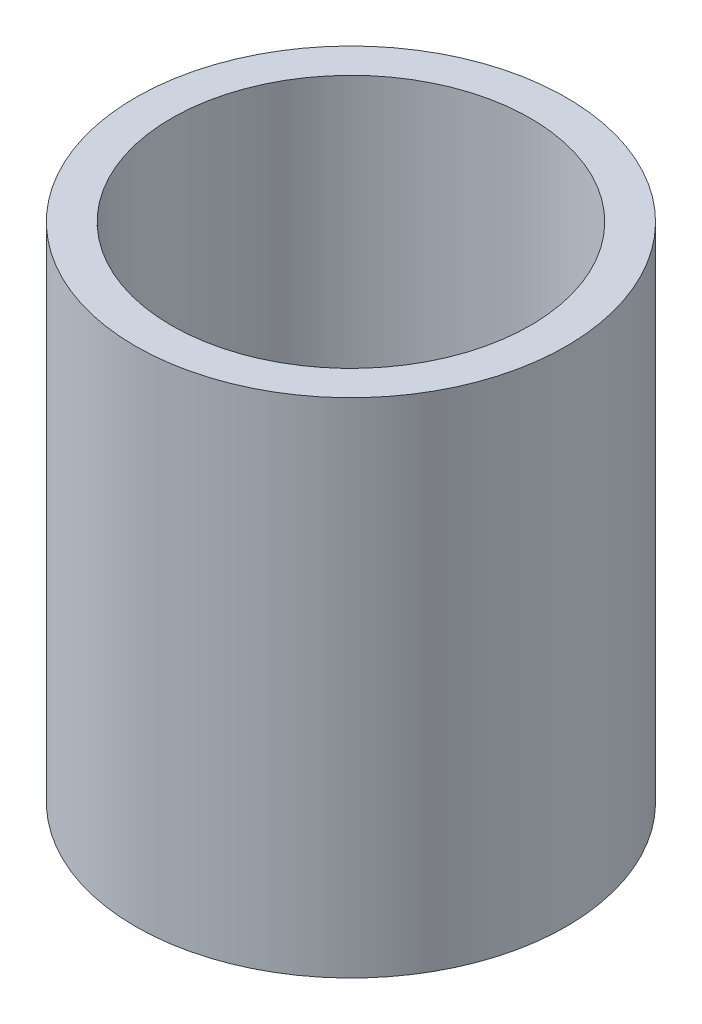
ISO-10303-21;
HEADER;
FILE_DESCRIPTION(('STEP AP214'),'2;1');
FILE_NAME('part.step','',(''),(''),'','','');
FILE_SCHEMA(('AUTOMOTIVE_DESIGN { 1 0 10303 214 1 1 1 1 }'));
ENDSEC;
DATA;
#1=APPLICATION_CONTEXT('core data for automotive mechanical design processes');
#2=APPLICATION_PROTOCOL_DEFINITION('international standard','automotive_design',2000,#1);
#3=PRODUCT_CONTEXT('',#1,'mechanical');
#4=PRODUCT('Part','Part','',(#3));
#5=PRODUCT_RELATED_PRODUCT_CATEGORY('part','',(#4));
#6=PRODUCT_DEFINITION_FORMATION('','',#4);
#7=PRODUCT_DEFINITION_CONTEXT('part definition',#1,'design');
#8=PRODUCT_DEFINITION('design','',#6,#7);
#9=PRODUCT_DEFINITION_SHAPE('','',#8);
#10=(LENGTH_UNIT() NAMED_UNIT(*) SI_UNIT(.MILLI.,.METRE.));
#11=(NAMED_UNIT(*) PLANE_ANGLE_UNIT() SI_UNIT($,.RADIAN.));
#12=(NAMED_UNIT(*) SI_UNIT($,.STERADIAN.) SOLID_ANGLE_UNIT());
#13=UNCERTAINTY_MEASURE_WITH_UNIT(LENGTH_MEASURE(1.E-05),#10,'distance_accuracy_value','');
#14=(GEOMETRIC_REPRESENTATION_CONTEXT(3) GLOBAL_UNCERTAINTY_ASSIGNED_CONTEXT((#13)) GLOBAL_UNIT_ASSIGNED_CONTEXT((#10,
#11,#12)) REPRESENTATION_CONTEXT('',''));
#15=CARTESIAN_POINT('',(0.,0.,0.));
#16=DIRECTION('',(0.,0.,1.));
#17=DIRECTION('',(1.,0.,0.));
#18=AXIS2_PLACEMENT_3D('',#15,#16,#17);
#19=CARTESIAN_POINT('',(0.,7.,0.));
#20=DIRECTION('',(0.,1.,0.));
#21=DIRECTION('',(0.,0.,1.));
#22=AXIS2_PLACEMENT_3D('',#19,#20,#21);
#23=PLANE('',#22);
#24=CARTESIAN_POINT('',(0.,7.,0.));
#25=DIRECTION('',(0.,1.,0.));
#26=DIRECTION('',(0.,0.,1.));
#27=AXIS2_PLACEMENT_3D('',#24,#25,#26);
#28=CIRCLE('',#27,3.);
#29=CARTESIAN_POINT('',(0.,7.,3.));
#30=VERTEX_POINT('',#29);
#31=EDGE_CURVE('E10',#30,#30,#28,.T.);
#32=ORIENTED_EDGE('',*,*,#31,.T.);
#33=EDGE_LOOP('',(#32));
#34=FACE_BOUND('',#33,.T.);
#35=CARTESIAN_POINT('',(0.,7.,0.));
#36=DIRECTION('',(0.,1.,0.));
#37=DIRECTION('',(0.,0.,1.));
#38=AXIS2_PLACEMENT_3D('',#35,#36,#37);
#39=CIRCLE('',#38,2.5);
#40=CARTESIAN_POINT('',(0.,7.,2.5));
#41=VERTEX_POINT('',#40);
#42=EDGE_CURVE('E42',#41,#41,#39,.T.);
#43=ORIENTED_EDGE('',*,*,#42,.F.);
#44=EDGE_LOOP('',(#43));
#45=FACE_BOUND('',#44,.T.);
#46=ADVANCED_FACE('F31',(#34,#45),#23,.T.);
#47=CARTESIAN_POINT('',(0.,0.,0.));
#48=DIRECTION('',(0.,1.,0.));
#49=DIRECTION('',(0.,0.,1.));
#50=AXIS2_PLACEMENT_3D('',#47,#48,#49);
#51=PLANE('',#50);
#52=CARTESIAN_POINT('',(0.,0.,0.));
#53=DIRECTION('',(0.,1.,0.));
#54=DIRECTION('',(0.,0.,1.));
#55=AXIS2_PLACEMENT_3D('',#52,#53,#54);
#56=CIRCLE('',#55,3.);
#57=CARTESIAN_POINT('',(0.,0.,3.));
#58=VERTEX_POINT('',#57);
#59=EDGE_CURVE('E35',#58,#58,#56,.T.);
#60=ORIENTED_EDGE('',*,*,#59,.F.);
#61=EDGE_LOOP('',(#60));
#62=FACE_BOUND('',#61,.T.);
#63=CARTESIAN_POINT('',(0.,0.,0.));
#64=DIRECTION('',(0.,1.,0.));
#65=DIRECTION('',(0.,0.,1.));
#66=AXIS2_PLACEMENT_3D('',#63,#64,#65);
#67=CIRCLE('',#66,2.5);
#68=CARTESIAN_POINT('',(0.,0.,2.5));
#69=VERTEX_POINT('',#68);
#70=EDGE_CURVE('E44',#69,#69,#67,.T.);
#71=ORIENTED_EDGE('',*,*,#70,.T.);
#72=EDGE_LOOP('',(#71));
#73=FACE_BOUND('',#72,.T.);
#74=ADVANCED_FACE('F54',(#62,#73),#51,.F.);
#75=CARTESIAN_POINT('',(0.,7.,0.));
#76=DIRECTION('',(0.,-1.,0.));
#77=DIRECTION('',(0.,0.,-1.));
#78=AXIS2_PLACEMENT_3D('',#75,#76,#77);
#79=CYLINDRICAL_SURFACE('',#78,3.);
#80=ORIENTED_EDGE('',*,*,#31,.F.);
#81=EDGE_LOOP('',(#80));
#82=FACE_BOUND('',#81,.T.);
#83=ORIENTED_EDGE('',*,*,#59,.T.);
#84=EDGE_LOOP('',(#83));
#85=FACE_BOUND('',#84,.T.);
#86=ADVANCED_FACE('F33',(#82,#85),#79,.T.);
#87=CARTESIAN_POINT('',(0.,7.,0.));
#88=DIRECTION('',(0.,-1.,0.));
#89=DIRECTION('',(0.,0.,-1.));
#90=AXIS2_PLACEMENT_3D('',#87,#88,#89);
#91=CYLINDRICAL_SURFACE('',#90,2.5);
#92=ORIENTED_EDGE('',*,*,#42,.T.);
#93=EDGE_LOOP('',(#92));
#94=FACE_BOUND('',#93,.T.);
#95=ORIENTED_EDGE('',*,*,#70,.F.);
#96=EDGE_LOOP('',(#95));
#97=FACE_BOUND('',#96,.T.);
#98=ADVANCED_FACE('F50',(#94,#97),#91,.F.);
#99=CLOSED_SHELL('',(#46,#74,#86,#98));
#100=MANIFOLD_SOLID_BREP('B2',#99);
#101=ADVANCED_BREP_SHAPE_REPRESENTATION('',(#18,#100),#14);
#102=SHAPE_DEFINITION_REPRESENTATION(#9,#101);
ENDSEC;
END-ISO-10303-21;
